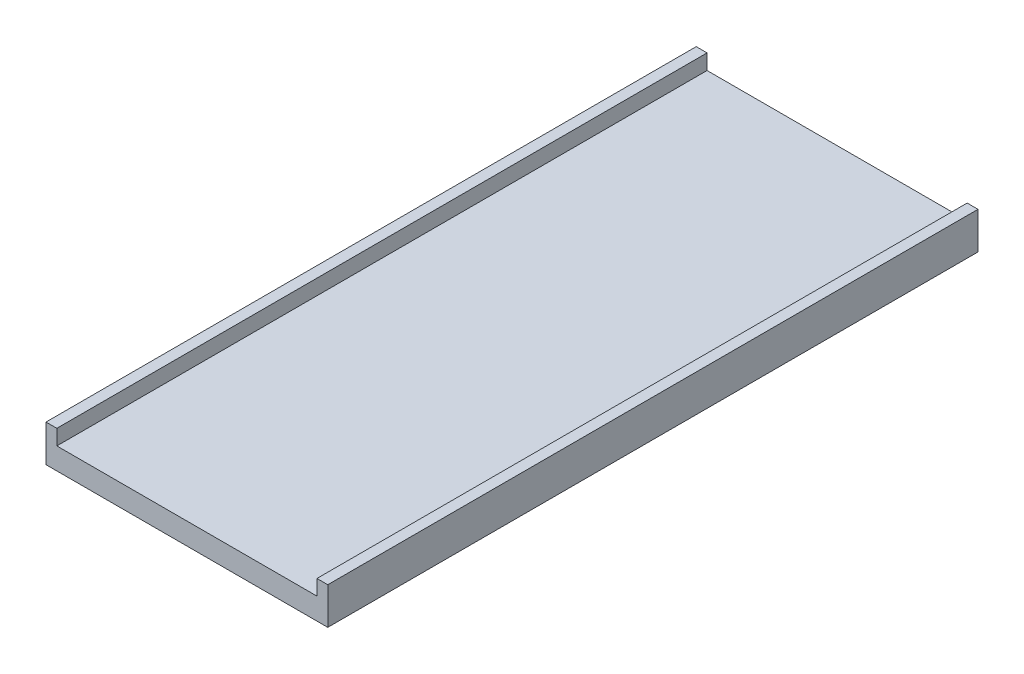
ISO-10303-21;
HEADER;
FILE_DESCRIPTION(('STEP AP214'),'2;1');
FILE_NAME('part.step','',(''),(''),'','','');
FILE_SCHEMA(('AUTOMOTIVE_DESIGN { 1 0 10303 214 1 1 1 1 }'));
ENDSEC;
DATA;
#1=APPLICATION_CONTEXT('core data for automotive mechanical design processes');
#2=APPLICATION_PROTOCOL_DEFINITION('international standard','automotive_design',2000,#1);
#3=PRODUCT_CONTEXT('',#1,'mechanical');
#4=PRODUCT('Part','Part','',(#3));
#5=PRODUCT_RELATED_PRODUCT_CATEGORY('part','',(#4));
#6=PRODUCT_DEFINITION_FORMATION('','',#4);
#7=PRODUCT_DEFINITION_CONTEXT('part definition',#1,'design');
#8=PRODUCT_DEFINITION('design','',#6,#7);
#9=PRODUCT_DEFINITION_SHAPE('','',#8);
#10=(LENGTH_UNIT() NAMED_UNIT(*) SI_UNIT(.MILLI.,.METRE.));
#11=(NAMED_UNIT(*) PLANE_ANGLE_UNIT() SI_UNIT($,.RADIAN.));
#12=(NAMED_UNIT(*) SI_UNIT($,.STERADIAN.) SOLID_ANGLE_UNIT());
#13=UNCERTAINTY_MEASURE_WITH_UNIT(LENGTH_MEASURE(1.E-05),#10,'distance_accuracy_value','');
#14=(GEOMETRIC_REPRESENTATION_CONTEXT(3) GLOBAL_UNCERTAINTY_ASSIGNED_CONTEXT((#13)) GLOBAL_UNIT_ASSIGNED_CONTEXT((#10,
#11,#12)) REPRESENTATION_CONTEXT('',''));
#15=CARTESIAN_POINT('',(0.,0.,0.));
#16=DIRECTION('',(0.,0.,1.));
#17=DIRECTION('',(1.,0.,0.));
#18=AXIS2_PLACEMENT_3D('',#15,#16,#17);
#19=CARTESIAN_POINT('',(25.,0.,1500.));
#20=DIRECTION('',(1.,0.,0.));
#21=DIRECTION('',(0.,1.,0.));
#22=AXIS2_PLACEMENT_3D('',#19,#20,#21);
#23=PLANE('',#22);
#24=DIRECTION('',(0.,-1.,0.));
#25=VECTOR('',#24,1.);
#26=CARTESIAN_POINT('',(25.,0.,0.));
#27=LINE('',#26,#25);
#28=CARTESIAN_POINT('',(25.,0.,0.));
#29=VERTEX_POINT('',#28);
#30=CARTESIAN_POINT('',(25.,-35.2360817477097,0.));
#31=VERTEX_POINT('',#30);
#32=EDGE_CURVE('E130',#29,#31,#27,.T.);
#33=ORIENTED_EDGE('',*,*,#32,.F.);
#34=DIRECTION('',(0.,0.,-1.));
#35=VECTOR('',#34,1.);
#36=CARTESIAN_POINT('',(25.,0.,1500.));
#37=LINE('',#36,#35);
#38=CARTESIAN_POINT('',(25.,0.,1500.));
#39=VERTEX_POINT('',#38);
#40=EDGE_CURVE('E11',#39,#29,#37,.T.);
#41=ORIENTED_EDGE('',*,*,#40,.F.);
#42=DIRECTION('',(0.,-1.,0.));
#43=VECTOR('',#42,1.);
#44=CARTESIAN_POINT('',(25.,0.,1500.));
#45=LINE('',#44,#43);
#46=CARTESIAN_POINT('',(25.,-35.2360817477097,1500.));
#47=VERTEX_POINT('',#46);
#48=EDGE_CURVE('E150',#39,#47,#45,.T.);
#49=ORIENTED_EDGE('',*,*,#48,.T.);
#50=DIRECTION('',(0.,0.,-1.));
#51=VECTOR('',#50,1.);
#52=CARTESIAN_POINT('',(25.,-35.2360817477097,1500.));
#53=LINE('',#52,#51);
#54=EDGE_CURVE('E36',#47,#31,#53,.T.);
#55=ORIENTED_EDGE('',*,*,#54,.T.);
#56=EDGE_LOOP('',(#33,#41,#49,#55));
#57=FACE_BOUND('',#56,.T.);
#58=ADVANCED_FACE('F33',(#57),#23,.T.);
#59=CARTESIAN_POINT('',(0.,0.,1500.));
#60=DIRECTION('',(0.,1.,0.));
#61=DIRECTION('',(0.,0.,1.));
#62=AXIS2_PLACEMENT_3D('',#59,#60,#61);
#63=PLANE('',#62);
#64=DIRECTION('',(1.,0.,0.));
#65=VECTOR('',#64,1.);
#66=CARTESIAN_POINT('',(0.,0.,0.));
#67=LINE('',#66,#65);
#68=CARTESIAN_POINT('',(0.,0.,0.));
#69=VERTEX_POINT('',#68);
#70=EDGE_CURVE('E148',#69,#29,#67,.T.);
#71=ORIENTED_EDGE('',*,*,#70,.F.);
#72=DIRECTION('',(0.,0.,-1.));
#73=VECTOR('',#72,1.);
#74=CARTESIAN_POINT('',(0.,0.,1500.));
#75=LINE('',#74,#73);
#76=CARTESIAN_POINT('',(0.,0.,1500.));
#77=VERTEX_POINT('',#76);
#78=EDGE_CURVE('E42',#77,#69,#75,.T.);
#79=ORIENTED_EDGE('',*,*,#78,.F.);
#80=DIRECTION('',(1.,0.,0.));
#81=VECTOR('',#80,1.);
#82=CARTESIAN_POINT('',(0.,0.,1500.));
#83=LINE('',#82,#81);
#84=EDGE_CURVE('E120',#77,#39,#83,.T.);
#85=ORIENTED_EDGE('',*,*,#84,.T.);
#86=ORIENTED_EDGE('',*,*,#40,.T.);
#87=EDGE_LOOP('',(#71,#79,#85,#86));
#88=FACE_BOUND('',#87,.T.);
#89=ADVANCED_FACE('F162',(#88),#63,.T.);
#90=CARTESIAN_POINT('',(0.,-85.2360817477096,1500.));
#91=DIRECTION('',(-1.,0.,0.));
#92=DIRECTION('',(0.,-1.,0.));
#93=AXIS2_PLACEMENT_3D('',#90,#91,#92);
#94=PLANE('',#93);
#95=DIRECTION('',(0.,1.,0.));
#96=VECTOR('',#95,1.);
#97=CARTESIAN_POINT('',(0.,-85.2360817477096,0.));
#98=LINE('',#97,#96);
#99=CARTESIAN_POINT('',(0.,-85.2360817477096,0.));
#100=VERTEX_POINT('',#99);
#101=EDGE_CURVE('E107',#100,#69,#98,.T.);
#102=ORIENTED_EDGE('',*,*,#101,.F.);
#103=DIRECTION('',(0.,0.,-1.));
#104=VECTOR('',#103,1.);
#105=CARTESIAN_POINT('',(0.,-85.2360817477096,1500.));
#106=LINE('',#105,#104);
#107=CARTESIAN_POINT('',(0.,-85.2360817477096,1500.));
#108=VERTEX_POINT('',#107);
#109=EDGE_CURVE('E102',#108,#100,#106,.T.);
#110=ORIENTED_EDGE('',*,*,#109,.F.);
#111=DIRECTION('',(0.,1.,0.));
#112=VECTOR('',#111,1.);
#113=CARTESIAN_POINT('',(0.,-85.2360817477096,1500.));
#114=LINE('',#113,#112);
#115=EDGE_CURVE('E105',#108,#77,#114,.T.);
#116=ORIENTED_EDGE('',*,*,#115,.T.);
#117=ORIENTED_EDGE('',*,*,#78,.T.);
#118=EDGE_LOOP('',(#102,#110,#116,#117));
#119=FACE_BOUND('',#118,.T.);
#120=ADVANCED_FACE('F104',(#119),#94,.T.);
#121=CARTESIAN_POINT('',(650.,-85.2360817477097,1500.));
#122=DIRECTION('',(0.,-1.,0.));
#123=DIRECTION('',(1.,0.,0.));
#124=AXIS2_PLACEMENT_3D('',#121,#122,#123);
#125=PLANE('',#124);
#126=DIRECTION('',(-1.,0.,0.));
#127=VECTOR('',#126,1.);
#128=CARTESIAN_POINT('',(650.,-85.2360817477097,0.));
#129=LINE('',#128,#127);
#130=CARTESIAN_POINT('',(650.,-85.2360817477097,0.));
#131=VERTEX_POINT('',#130);
#132=EDGE_CURVE('E145',#131,#100,#129,.T.);
#133=ORIENTED_EDGE('',*,*,#132,.F.);
#134=DIRECTION('',(0.,0.,-1.));
#135=VECTOR('',#134,1.);
#136=CARTESIAN_POINT('',(650.,-85.2360817477097,1500.));
#137=LINE('',#136,#135);
#138=CARTESIAN_POINT('',(650.,-85.2360817477097,1500.));
#139=VERTEX_POINT('',#138);
#140=EDGE_CURVE('E112',#139,#131,#137,.T.);
#141=ORIENTED_EDGE('',*,*,#140,.F.);
#142=DIRECTION('',(-1.,0.,0.));
#143=VECTOR('',#142,1.);
#144=CARTESIAN_POINT('',(650.,-85.2360817477097,1500.));
#145=LINE('',#144,#143);
#146=EDGE_CURVE('E118',#139,#108,#145,.T.);
#147=ORIENTED_EDGE('',*,*,#146,.T.);
#148=ORIENTED_EDGE('',*,*,#109,.T.);
#149=EDGE_LOOP('',(#133,#141,#147,#148));
#150=FACE_BOUND('',#149,.T.);
#151=ADVANCED_FACE('F122',(#150),#125,.T.);
#152=CARTESIAN_POINT('',(650.,0.,1500.));
#153=DIRECTION('',(1.,0.,0.));
#154=DIRECTION('',(0.,0.,-1.));
#155=AXIS2_PLACEMENT_3D('',#152,#153,#154);
#156=PLANE('',#155);
#157=DIRECTION('',(0.,-1.,0.));
#158=VECTOR('',#157,1.);
#159=CARTESIAN_POINT('',(650.,0.,0.));
#160=LINE('',#159,#158);
#161=CARTESIAN_POINT('',(650.,0.,0.));
#162=VERTEX_POINT('',#161);
#163=EDGE_CURVE('E142',#162,#131,#160,.T.);
#164=ORIENTED_EDGE('',*,*,#163,.F.);
#165=DIRECTION('',(0.,0.,-1.));
#166=VECTOR('',#165,1.);
#167=CARTESIAN_POINT('',(650.,0.,1500.));
#168=LINE('',#167,#166);
#169=CARTESIAN_POINT('',(650.,0.,1500.));
#170=VERTEX_POINT('',#169);
#171=EDGE_CURVE('E154',#170,#162,#168,.T.);
#172=ORIENTED_EDGE('',*,*,#171,.F.);
#173=DIRECTION('',(0.,-1.,0.));
#174=VECTOR('',#173,1.);
#175=CARTESIAN_POINT('',(650.,0.,1500.));
#176=LINE('',#175,#174);
#177=EDGE_CURVE('E123',#170,#139,#176,.T.);
#178=ORIENTED_EDGE('',*,*,#177,.T.);
#179=ORIENTED_EDGE('',*,*,#140,.T.);
#180=EDGE_LOOP('',(#164,#172,#178,#179));
#181=FACE_BOUND('',#180,.T.);
#182=ADVANCED_FACE('F175',(#181),#156,.T.);
#183=CARTESIAN_POINT('',(625.,0.,1500.));
#184=DIRECTION('',(0.,1.,0.));
#185=DIRECTION('',(0.,0.,1.));
#186=AXIS2_PLACEMENT_3D('',#183,#184,#185);
#187=PLANE('',#186);
#188=DIRECTION('',(1.,0.,0.));
#189=VECTOR('',#188,1.);
#190=CARTESIAN_POINT('',(625.,0.,0.));
#191=LINE('',#190,#189);
#192=CARTESIAN_POINT('',(625.,0.,0.));
#193=VERTEX_POINT('',#192);
#194=EDGE_CURVE('E139',#193,#162,#191,.T.);
#195=ORIENTED_EDGE('',*,*,#194,.F.);
#196=DIRECTION('',(0.,0.,-1.));
#197=VECTOR('',#196,1.);
#198=CARTESIAN_POINT('',(625.,0.,1500.));
#199=LINE('',#198,#197);
#200=CARTESIAN_POINT('',(625.,0.,1500.));
#201=VERTEX_POINT('',#200);
#202=EDGE_CURVE('E156',#201,#193,#199,.T.);
#203=ORIENTED_EDGE('',*,*,#202,.F.);
#204=DIRECTION('',(1.,0.,0.));
#205=VECTOR('',#204,1.);
#206=CARTESIAN_POINT('',(625.,0.,1500.));
#207=LINE('',#206,#205);
#208=EDGE_CURVE('E125',#201,#170,#207,.T.);
#209=ORIENTED_EDGE('',*,*,#208,.T.);
#210=ORIENTED_EDGE('',*,*,#171,.T.);
#211=EDGE_LOOP('',(#195,#203,#209,#210));
#212=FACE_BOUND('',#211,.T.);
#213=ADVANCED_FACE('F178',(#212),#187,.T.);
#214=CARTESIAN_POINT('',(625.,-35.2360817477097,1500.));
#215=DIRECTION('',(-1.,0.,0.));
#216=DIRECTION('',(0.,0.,1.));
#217=AXIS2_PLACEMENT_3D('',#214,#215,#216);
#218=PLANE('',#217);
#219=DIRECTION('',(0.,1.,0.));
#220=VECTOR('',#219,1.);
#221=CARTESIAN_POINT('',(625.,-35.2360817477097,0.));
#222=LINE('',#221,#220);
#223=CARTESIAN_POINT('',(625.,-35.2360817477097,0.));
#224=VERTEX_POINT('',#223);
#225=EDGE_CURVE('E136',#224,#193,#222,.T.);
#226=ORIENTED_EDGE('',*,*,#225,.F.);
#227=DIRECTION('',(0.,0.,-1.));
#228=VECTOR('',#227,1.);
#229=CARTESIAN_POINT('',(625.,-35.2360817477097,1500.));
#230=LINE('',#229,#228);
#231=CARTESIAN_POINT('',(625.,-35.2360817477097,1500.));
#232=VERTEX_POINT('',#231);
#233=EDGE_CURVE('E157',#232,#224,#230,.T.);
#234=ORIENTED_EDGE('',*,*,#233,.F.);
#235=DIRECTION('',(0.,1.,0.));
#236=VECTOR('',#235,1.);
#237=CARTESIAN_POINT('',(625.,-35.2360817477097,1500.));
#238=LINE('',#237,#236);
#239=EDGE_CURVE('E253',#232,#201,#238,.T.);
#240=ORIENTED_EDGE('',*,*,#239,.T.);
#241=ORIENTED_EDGE('',*,*,#202,.T.);
#242=EDGE_LOOP('',(#226,#234,#240,#241));
#243=FACE_BOUND('',#242,.T.);
#244=ADVANCED_FACE('F182',(#243),#218,.T.);
#245=CARTESIAN_POINT('',(25.,-35.2360817477097,1500.));
#246=DIRECTION('',(0.,1.,0.));
#247=DIRECTION('',(0.,0.,1.));
#248=AXIS2_PLACEMENT_3D('',#245,#246,#247);
#249=PLANE('',#248);
#250=DIRECTION('',(1.,0.,0.));
#251=VECTOR('',#250,1.);
#252=CARTESIAN_POINT('',(25.,-35.2360817477097,0.));
#253=LINE('',#252,#251);
#254=EDGE_CURVE('E133',#31,#224,#253,.T.);
#255=ORIENTED_EDGE('',*,*,#254,.F.);
#256=ORIENTED_EDGE('',*,*,#54,.F.);
#257=DIRECTION('',(1.,0.,0.));
#258=VECTOR('',#257,1.);
#259=CARTESIAN_POINT('',(25.,-35.2360817477097,1500.));
#260=LINE('',#259,#258);
#261=EDGE_CURVE('E254',#47,#232,#260,.T.);
#262=ORIENTED_EDGE('',*,*,#261,.T.);
#263=ORIENTED_EDGE('',*,*,#233,.T.);
#264=EDGE_LOOP('',(#255,#256,#262,#263));
#265=FACE_BOUND('',#264,.T.);
#266=ADVANCED_FACE('F159',(#265),#249,.T.);
#267=CARTESIAN_POINT('',(0.,0.,1500.));
#268=DIRECTION('',(0.,0.,1.));
#269=DIRECTION('',(1.,0.,0.));
#270=AXIS2_PLACEMENT_3D('',#267,#268,#269);
#271=PLANE('',#270);
#272=ORIENTED_EDGE('',*,*,#48,.F.);
#273=ORIENTED_EDGE('',*,*,#84,.F.);
#274=ORIENTED_EDGE('',*,*,#115,.F.);
#275=ORIENTED_EDGE('',*,*,#146,.F.);
#276=ORIENTED_EDGE('',*,*,#177,.F.);
#277=ORIENTED_EDGE('',*,*,#208,.F.);
#278=ORIENTED_EDGE('',*,*,#239,.F.);
#279=ORIENTED_EDGE('',*,*,#261,.F.);
#280=EDGE_LOOP('',(#272,#273,#274,#275,#276,#277,#278,#279));
#281=FACE_BOUND('',#280,.T.);
#282=ADVANCED_FACE('F116',(#281),#271,.T.);
#283=CARTESIAN_POINT('',(0.,0.,0.));
#284=DIRECTION('',(0.,0.,1.));
#285=DIRECTION('',(1.,0.,0.));
#286=AXIS2_PLACEMENT_3D('',#283,#284,#285);
#287=PLANE('',#286);
#288=ORIENTED_EDGE('',*,*,#32,.T.);
#289=ORIENTED_EDGE('',*,*,#254,.T.);
#290=ORIENTED_EDGE('',*,*,#225,.T.);
#291=ORIENTED_EDGE('',*,*,#194,.T.);
#292=ORIENTED_EDGE('',*,*,#163,.T.);
#293=ORIENTED_EDGE('',*,*,#132,.T.);
#294=ORIENTED_EDGE('',*,*,#101,.T.);
#295=ORIENTED_EDGE('',*,*,#70,.T.);
#296=EDGE_LOOP('',(#288,#289,#290,#291,#292,#293,#294,#295));
#297=FACE_BOUND('',#296,.T.);
#298=ADVANCED_FACE('F161',(#297),#287,.F.);
#299=CLOSED_SHELL('',(#58,#89,#120,#151,#182,#213,#244,#266,#282,#298));
#300=MANIFOLD_SOLID_BREP('B2',#299);
#301=ADVANCED_BREP_SHAPE_REPRESENTATION('',(#18,#300),#14);
#302=SHAPE_DEFINITION_REPRESENTATION(#9,#301);
ENDSEC;
END-ISO-10303-21;
